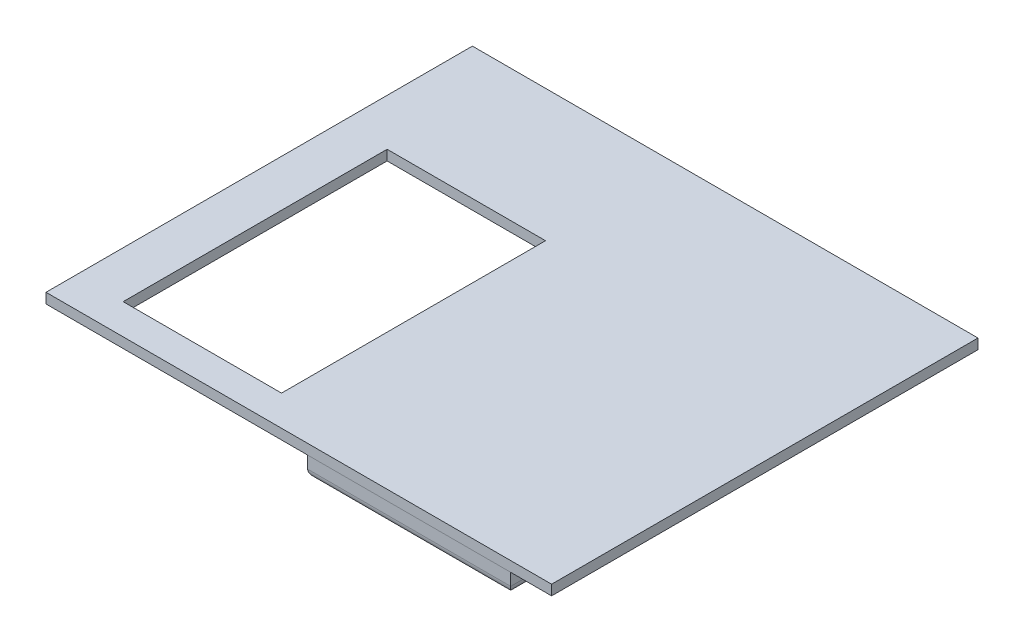
ISO-10303-21;
HEADER;
FILE_DESCRIPTION(('STEP AP214'),'2;1');
FILE_NAME('part.step','',(''),(''),'','','');
FILE_SCHEMA(('AUTOMOTIVE_DESIGN { 1 0 10303 214 1 1 1 1 }'));
ENDSEC;
DATA;
#1=APPLICATION_CONTEXT('core data for automotive mechanical design processes');
#2=APPLICATION_PROTOCOL_DEFINITION('international standard','automotive_design',2000,#1);
#3=PRODUCT_CONTEXT('',#1,'mechanical');
#4=PRODUCT('Part','Part','',(#3));
#5=PRODUCT_RELATED_PRODUCT_CATEGORY('part','',(#4));
#6=PRODUCT_DEFINITION_FORMATION('','',#4);
#7=PRODUCT_DEFINITION_CONTEXT('part definition',#1,'design');
#8=PRODUCT_DEFINITION('design','',#6,#7);
#9=PRODUCT_DEFINITION_SHAPE('','',#8);
#10=(LENGTH_UNIT() NAMED_UNIT(*) SI_UNIT(.MILLI.,.METRE.));
#11=(NAMED_UNIT(*) PLANE_ANGLE_UNIT() SI_UNIT($,.RADIAN.));
#12=(NAMED_UNIT(*) SI_UNIT($,.STERADIAN.) SOLID_ANGLE_UNIT());
#13=UNCERTAINTY_MEASURE_WITH_UNIT(LENGTH_MEASURE(1.E-05),#10,'distance_accuracy_value','');
#14=(GEOMETRIC_REPRESENTATION_CONTEXT(3) GLOBAL_UNCERTAINTY_ASSIGNED_CONTEXT((#13)) GLOBAL_UNIT_ASSIGNED_CONTEXT((#10,
#11,#12)) REPRESENTATION_CONTEXT('',''));
#15=CARTESIAN_POINT('',(0.,0.,0.));
#16=DIRECTION('',(0.,0.,1.));
#17=DIRECTION('',(1.,0.,0.));
#18=AXIS2_PLACEMENT_3D('',#15,#16,#17);
#19=CARTESIAN_POINT('',(52.6626972357937,-5.00000000000001,53.4495540641216));
#20=DIRECTION('',(1.,0.,0.));
#21=DIRECTION('',(0.,0.,1.));
#22=AXIS2_PLACEMENT_3D('',#19,#20,#21);
#23=PLANE('',#22);
#24=DIRECTION('',(0.,1.,0.));
#25=VECTOR('',#24,1.);
#26=CARTESIAN_POINT('',(52.6626972357937,-5.00000000000001,-26.5504459358784));
#27=LINE('',#26,#25);
#28=CARTESIAN_POINT('',(52.6626972357937,-3.00000000000001,-26.5504459358784));
#29=VERTEX_POINT('',#28);
#30=CARTESIAN_POINT('',(52.6626972357937,0.,-26.5504459358784));
#31=VERTEX_POINT('',#30);
#32=EDGE_CURVE('E119',#29,#31,#27,.T.);
#33=ORIENTED_EDGE('',*,*,#32,.F.);
#34=DIRECTION('',(0.,0.,-1.));
#35=VECTOR('',#34,1.);
#36=CARTESIAN_POINT('',(52.6626972357937,-3.00000000000001,53.4495540641216));
#37=LINE('',#36,#35);
#38=CARTESIAN_POINT('',(52.6626972357937,-3.00000000000001,53.4495540641216));
#39=VERTEX_POINT('',#38);
#40=EDGE_CURVE('E194',#29,#39,#37,.F.);
#41=ORIENTED_EDGE('',*,*,#40,.T.);
#42=DIRECTION('',(0.,1.,0.));
#43=VECTOR('',#42,1.);
#44=CARTESIAN_POINT('',(52.6626972357937,-5.00000000000001,53.4495540641216));
#45=LINE('',#44,#43);
#46=CARTESIAN_POINT('',(52.6626972357937,0.,53.4495540641216));
#47=VERTEX_POINT('',#46);
#48=EDGE_CURVE('E139',#39,#47,#45,.T.);
#49=ORIENTED_EDGE('',*,*,#48,.T.);
#50=DIRECTION('',(0.,0.,-1.));
#51=VECTOR('',#50,1.);
#52=CARTESIAN_POINT('',(52.6626972357937,0.,53.4495540641216));
#53=LINE('',#52,#51);
#54=EDGE_CURVE('E134',#47,#31,#53,.T.);
#55=ORIENTED_EDGE('',*,*,#54,.T.);
#56=EDGE_LOOP('',(#33,#41,#49,#55));
#57=FACE_BOUND('',#56,.T.);
#58=ADVANCED_FACE('F52',(#57),#23,.F.);
#59=CARTESIAN_POINT('',(52.6626972357937,-5.00000000000001,-26.5504459358784));
#60=DIRECTION('',(0.,0.,1.));
#61=DIRECTION('',(0.,-1.,0.));
#62=AXIS2_PLACEMENT_3D('',#59,#60,#61);
#63=PLANE('',#62);
#64=DIRECTION('',(0.,1.,0.));
#65=VECTOR('',#64,1.);
#66=CARTESIAN_POINT('',(102.662697235794,-5.00000000000001,-26.5504459358784));
#67=LINE('',#66,#65);
#68=CARTESIAN_POINT('',(102.662697235794,-3.00000000000001,-26.5504459358784));
#69=VERTEX_POINT('',#68);
#70=CARTESIAN_POINT('',(102.662697235794,0.,-26.5504459358784));
#71=VERTEX_POINT('',#70);
#72=EDGE_CURVE('E128',#69,#71,#67,.T.);
#73=ORIENTED_EDGE('',*,*,#72,.F.);
#74=DIRECTION('',(1.,0.,0.));
#75=VECTOR('',#74,1.);
#76=CARTESIAN_POINT('',(52.6626972357937,-3.00000000000001,-26.5504459358784));
#77=LINE('',#76,#75);
#78=EDGE_CURVE('E70',#69,#29,#77,.F.);
#79=ORIENTED_EDGE('',*,*,#78,.T.);
#80=ORIENTED_EDGE('',*,*,#32,.T.);
#81=DIRECTION('',(1.,0.,0.));
#82=VECTOR('',#81,1.);
#83=CARTESIAN_POINT('',(52.6626972357937,0.,-26.5504459358784));
#84=LINE('',#83,#82);
#85=EDGE_CURVE('E122',#31,#71,#84,.T.);
#86=ORIENTED_EDGE('',*,*,#85,.T.);
#87=EDGE_LOOP('',(#73,#79,#80,#86));
#88=FACE_BOUND('',#87,.T.);
#89=ADVANCED_FACE('F121',(#88),#63,.F.);
#90=CARTESIAN_POINT('',(102.662697235794,-5.00000000000001,53.4495540641216));
#91=DIRECTION('',(-1.,0.,0.));
#92=DIRECTION('',(0.,0.,-1.));
#93=AXIS2_PLACEMENT_3D('',#90,#91,#92);
#94=PLANE('',#93);
#95=DIRECTION('',(0.,1.,0.));
#96=VECTOR('',#95,1.);
#97=CARTESIAN_POINT('',(102.662697235794,-5.00000000000001,53.4495540641216));
#98=LINE('',#97,#96);
#99=CARTESIAN_POINT('',(102.662697235794,-3.00000000000001,53.4495540641216));
#100=VERTEX_POINT('',#99);
#101=CARTESIAN_POINT('',(102.662697235794,0.,53.4495540641216));
#102=VERTEX_POINT('',#101);
#103=EDGE_CURVE('E153',#100,#102,#98,.T.);
#104=ORIENTED_EDGE('',*,*,#103,.F.);
#105=DIRECTION('',(0.,0.,1.));
#106=VECTOR('',#105,1.);
#107=CARTESIAN_POINT('',(102.662697235794,-3.00000000000001,-26.5504459358784));
#108=LINE('',#107,#106);
#109=EDGE_CURVE('E78',#100,#69,#108,.F.);
#110=ORIENTED_EDGE('',*,*,#109,.T.);
#111=ORIENTED_EDGE('',*,*,#72,.T.);
#112=DIRECTION('',(0.,0.,1.));
#113=VECTOR('',#112,1.);
#114=CARTESIAN_POINT('',(102.662697235794,0.,53.4495540641216));
#115=LINE('',#114,#113);
#116=EDGE_CURVE('E136',#71,#102,#115,.T.);
#117=ORIENTED_EDGE('',*,*,#116,.T.);
#118=EDGE_LOOP('',(#104,#110,#111,#117));
#119=FACE_BOUND('',#118,.T.);
#120=ADVANCED_FACE('F258',(#119),#94,.F.);
#121=CARTESIAN_POINT('',(52.6626972357937,-5.00000000000001,53.4495540641216));
#122=DIRECTION('',(0.,0.,-1.));
#123=DIRECTION('',(0.,1.,0.));
#124=AXIS2_PLACEMENT_3D('',#121,#122,#123);
#125=PLANE('',#124);
#126=ORIENTED_EDGE('',*,*,#48,.F.);
#127=DIRECTION('',(-1.,0.,0.));
#128=VECTOR('',#127,1.);
#129=CARTESIAN_POINT('',(102.662697235794,-3.00000000000001,53.4495540641216));
#130=LINE('',#129,#128);
#131=EDGE_CURVE('E188',#39,#100,#130,.F.);
#132=ORIENTED_EDGE('',*,*,#131,.T.);
#133=ORIENTED_EDGE('',*,*,#103,.T.);
#134=DIRECTION('',(-1.,0.,0.));
#135=VECTOR('',#134,1.);
#136=CARTESIAN_POINT('',(52.6626972357937,0.,53.4495540641216));
#137=LINE('',#136,#135);
#138=EDGE_CURVE('E150',#102,#47,#137,.T.);
#139=ORIENTED_EDGE('',*,*,#138,.T.);
#140=EDGE_LOOP('',(#126,#132,#133,#139));
#141=FACE_BOUND('',#140,.T.);
#142=ADVANCED_FACE('F353',(#141),#125,.F.);
#143=CARTESIAN_POINT('',(52.6626972357937,-5.00000000000001,-26.5504459358784));
#144=DIRECTION('',(0.,-1.,0.));
#145=DIRECTION('',(1.,0.,0.));
#146=AXIS2_PLACEMENT_3D('',#143,#144,#145);
#147=PLANE('',#146);
#148=CARTESIAN_POINT('',(77.6626972357937,-5.00000000000001,-18.5504459358784));
#149=DIRECTION('',(0.,-1.,0.));
#150=DIRECTION('',(1.,0.,0.));
#151=AXIS2_PLACEMENT_3D('',#148,#149,#150);
#152=CIRCLE('',#151,2.5);
#153=CARTESIAN_POINT('',(80.1626972357937,-5.00000000000001,-18.5504459358784));
#154=VERTEX_POINT('',#153);
#155=EDGE_CURVE('E315',#154,#154,#152,.T.);
#156=ORIENTED_EDGE('',*,*,#155,.F.);
#157=EDGE_LOOP('',(#156));
#158=FACE_BOUND('',#157,.T.);
#159=CARTESIAN_POINT('',(77.6626972357937,-5.00000000000001,45.4495540641216));
#160=DIRECTION('',(0.,-1.,0.));
#161=DIRECTION('',(1.,0.,0.));
#162=AXIS2_PLACEMENT_3D('',#159,#160,#161);
#163=CIRCLE('',#162,2.5);
#164=CARTESIAN_POINT('',(80.1626972357937,-5.00000000000001,45.4495540641216));
#165=VERTEX_POINT('',#164);
#166=EDGE_CURVE('E311',#165,#165,#163,.T.);
#167=ORIENTED_EDGE('',*,*,#166,.F.);
#168=EDGE_LOOP('',(#167));
#169=FACE_BOUND('',#168,.T.);
#170=DIRECTION('',(0.,0.,1.));
#171=VECTOR('',#170,1.);
#172=CARTESIAN_POINT('',(100.662697235794,-5.00000000000001,53.4495540641216));
#173=LINE('',#172,#171);
#174=CARTESIAN_POINT('',(100.662697235794,-5.00000000000001,-24.5504459358784));
#175=VERTEX_POINT('',#174);
#176=CARTESIAN_POINT('',(100.662697235794,-5.00000000000001,51.4495540641216));
#177=VERTEX_POINT('',#176);
#178=EDGE_CURVE('E182',#175,#177,#173,.T.);
#179=ORIENTED_EDGE('',*,*,#178,.T.);
#180=DIRECTION('',(-1.,0.,0.));
#181=VECTOR('',#180,1.);
#182=CARTESIAN_POINT('',(52.6626972357937,-5.00000000000001,51.4495540641216));
#183=LINE('',#182,#181);
#184=CARTESIAN_POINT('',(54.6626972357937,-5.00000000000001,51.4495540641216));
#185=VERTEX_POINT('',#184);
#186=EDGE_CURVE('E185',#177,#185,#183,.T.);
#187=ORIENTED_EDGE('',*,*,#186,.T.);
#188=DIRECTION('',(0.,0.,-1.));
#189=VECTOR('',#188,1.);
#190=CARTESIAN_POINT('',(54.6626972357937,-5.00000000000001,-26.5504459358784));
#191=LINE('',#190,#189);
#192=CARTESIAN_POINT('',(54.6626972357937,-5.00000000000001,-24.5504459358784));
#193=VERTEX_POINT('',#192);
#194=EDGE_CURVE('E178',#185,#193,#191,.T.);
#195=ORIENTED_EDGE('',*,*,#194,.T.);
#196=DIRECTION('',(1.,0.,0.));
#197=VECTOR('',#196,1.);
#198=CARTESIAN_POINT('',(102.662697235794,-5.00000000000001,-24.5504459358784));
#199=LINE('',#198,#197);
#200=EDGE_CURVE('E180',#193,#175,#199,.T.);
#201=ORIENTED_EDGE('',*,*,#200,.T.);
#202=EDGE_LOOP('',(#179,#187,#195,#201));
#203=FACE_BOUND('',#202,.T.);
#204=CARTESIAN_POINT('',(67.6626972357937,-5.00000000000001,-11.5504459358784));
#205=DIRECTION('',(0.,-1.,0.));
#206=DIRECTION('',(1.,0.,0.));
#207=AXIS2_PLACEMENT_3D('',#204,#205,#206);
#208=CIRCLE('',#207,5.);
#209=CARTESIAN_POINT('',(72.6626972357937,-5.00000000000001,-11.5504459358784));
#210=VERTEX_POINT('',#209);
#211=EDGE_CURVE('E175',#210,#210,#208,.F.);
#212=ORIENTED_EDGE('',*,*,#211,.T.);
#213=EDGE_LOOP('',(#212));
#214=FACE_BOUND('',#213,.T.);
#215=CARTESIAN_POINT('',(87.6626972357937,-5.00000000000001,-11.5504459358784));
#216=DIRECTION('',(0.,-1.,0.));
#217=DIRECTION('',(1.,0.,0.));
#218=AXIS2_PLACEMENT_3D('',#215,#216,#217);
#219=CIRCLE('',#218,5.);
#220=CARTESIAN_POINT('',(92.6626972357937,-5.00000000000001,-11.5504459358784));
#221=VERTEX_POINT('',#220);
#222=EDGE_CURVE('E171',#221,#221,#219,.F.);
#223=ORIENTED_EDGE('',*,*,#222,.T.);
#224=EDGE_LOOP('',(#223));
#225=FACE_BOUND('',#224,.T.);
#226=CARTESIAN_POINT('',(90.6626972357937,-5.00000000000001,3.337179155652));
#227=DIRECTION('',(0.,-1.,0.));
#228=DIRECTION('',(1.,0.,0.));
#229=AXIS2_PLACEMENT_3D('',#226,#227,#228);
#230=CIRCLE('',#229,6.);
#231=CARTESIAN_POINT('',(96.6626972357937,-5.00000000000001,3.337179155652));
#232=VERTEX_POINT('',#231);
#233=EDGE_CURVE('E168',#232,#232,#230,.F.);
#234=ORIENTED_EDGE('',*,*,#233,.T.);
#235=EDGE_LOOP('',(#234));
#236=FACE_BOUND('',#235,.T.);
#237=CARTESIAN_POINT('',(64.6626972357937,-5.00000000000001,3.337179155652));
#238=DIRECTION('',(0.,-1.,0.));
#239=DIRECTION('',(1.,0.,0.));
#240=AXIS2_PLACEMENT_3D('',#237,#238,#239);
#241=CIRCLE('',#240,6.);
#242=CARTESIAN_POINT('',(70.6626972357937,-5.00000000000001,3.337179155652));
#243=VERTEX_POINT('',#242);
#244=EDGE_CURVE('E165',#243,#243,#241,.F.);
#245=ORIENTED_EDGE('',*,*,#244,.T.);
#246=EDGE_LOOP('',(#245));
#247=FACE_BOUND('',#246,.T.);
#248=CARTESIAN_POINT('',(77.6626972357937,-5.00000000000001,23.4495540641216));
#249=DIRECTION('',(0.,-1.,0.));
#250=DIRECTION('',(1.,0.,0.));
#251=AXIS2_PLACEMENT_3D('',#248,#249,#250);
#252=CIRCLE('',#251,5.5);
#253=CARTESIAN_POINT('',(83.1626972357937,-5.00000000000001,23.4495540641216));
#254=VERTEX_POINT('',#253);
#255=CARTESIAN_POINT('',(74.8267946017105,-5.00000000000001,28.1620540641216));
#256=VERTEX_POINT('',#255);
#257=EDGE_CURVE('E127',#254,#256,#252,.F.);
#258=ORIENTED_EDGE('',*,*,#257,.T.);
#259=CARTESIAN_POINT('',(77.6626972357937,-5.00000000000001,33.4495540641216));
#260=DIRECTION('',(0.,-1.,0.));
#261=DIRECTION('',(1.,0.,0.));
#262=AXIS2_PLACEMENT_3D('',#259,#260,#261);
#263=CIRCLE('',#262,6.);
#264=CARTESIAN_POINT('',(83.6626972357937,-5.00000000000001,33.4495540641216));
#265=VERTEX_POINT('',#264);
#266=EDGE_CURVE('E162',#256,#265,#263,.F.);
#267=ORIENTED_EDGE('',*,*,#266,.T.);
#268=CARTESIAN_POINT('',(77.6626972357937,-5.00000000000001,33.4495540641216));
#269=DIRECTION('',(0.,-1.,0.));
#270=DIRECTION('',(1.,0.,0.));
#271=AXIS2_PLACEMENT_3D('',#268,#269,#270);
#272=CIRCLE('',#271,6.);
#273=CARTESIAN_POINT('',(80.4985998698769,-5.00000000000001,28.1620540641216));
#274=VERTEX_POINT('',#273);
#275=EDGE_CURVE('E160',#265,#274,#272,.F.);
#276=ORIENTED_EDGE('',*,*,#275,.T.);
#277=CARTESIAN_POINT('',(77.6626972357937,-5.00000000000001,23.4495540641216));
#278=DIRECTION('',(0.,-1.,0.));
#279=DIRECTION('',(1.,0.,0.));
#280=AXIS2_PLACEMENT_3D('',#277,#278,#279);
#281=CIRCLE('',#280,5.5);
#282=EDGE_CURVE('E158',#274,#254,#281,.F.);
#283=ORIENTED_EDGE('',*,*,#282,.T.);
#284=EDGE_LOOP('',(#258,#267,#276,#283));
#285=FACE_BOUND('',#284,.T.);
#286=ADVANCED_FACE('F350',(#158,#169,#203,#214,#225,#236,#247,#285),#147,.T.);
#287=CARTESIAN_POINT('',(52.6626972357937,0.,-26.5504459358784));
#288=DIRECTION('',(0.,-1.,0.));
#289=DIRECTION('',(1.,0.,0.));
#290=AXIS2_PLACEMENT_3D('',#287,#288,#289);
#291=PLANE('',#290);
#292=CARTESIAN_POINT('',(77.6626972357937,0.,-18.5504459358784));
#293=DIRECTION('',(0.,-1.,0.));
#294=DIRECTION('',(1.,0.,0.));
#295=AXIS2_PLACEMENT_3D('',#292,#293,#294);
#296=CIRCLE('',#295,2.5);
#297=CARTESIAN_POINT('',(80.1626972357937,0.,-18.5504459358784));
#298=VERTEX_POINT('',#297);
#299=EDGE_CURVE('E56',#298,#298,#296,.T.);
#300=ORIENTED_EDGE('',*,*,#299,.T.);
#301=EDGE_LOOP('',(#300));
#302=FACE_BOUND('',#301,.T.);
#303=CARTESIAN_POINT('',(77.6626972357937,0.,45.4495540641216));
#304=DIRECTION('',(0.,-1.,0.));
#305=DIRECTION('',(1.,0.,0.));
#306=AXIS2_PLACEMENT_3D('',#303,#304,#305);
#307=CIRCLE('',#306,2.5);
#308=CARTESIAN_POINT('',(80.1626972357937,0.,45.4495540641216));
#309=VERTEX_POINT('',#308);
#310=EDGE_CURVE('E231',#309,#309,#307,.T.);
#311=ORIENTED_EDGE('',*,*,#310,.T.);
#312=EDGE_LOOP('',(#311));
#313=FACE_BOUND('',#312,.T.);
#314=CARTESIAN_POINT('',(77.6626972357937,0.,23.4495540641216));
#315=DIRECTION('',(0.,-1.,0.));
#316=DIRECTION('',(1.,0.,0.));
#317=AXIS2_PLACEMENT_3D('',#314,#315,#316);
#318=CIRCLE('',#317,3.5);
#319=CARTESIAN_POINT('',(81.1626972357937,0.,23.4495540641216));
#320=VERTEX_POINT('',#319);
#321=EDGE_CURVE('E223',#320,#320,#318,.T.);
#322=ORIENTED_EDGE('',*,*,#321,.T.);
#323=EDGE_LOOP('',(#322));
#324=FACE_BOUND('',#323,.T.);
#325=CARTESIAN_POINT('',(64.6626972357937,0.,3.337179155652));
#326=DIRECTION('',(0.,-1.,0.));
#327=DIRECTION('',(1.,0.,0.));
#328=AXIS2_PLACEMENT_3D('',#325,#326,#327);
#329=CIRCLE('',#328,4.);
#330=CARTESIAN_POINT('',(68.6626972357937,0.,3.337179155652));
#331=VERTEX_POINT('',#330);
#332=EDGE_CURVE('E306',#331,#331,#329,.T.);
#333=ORIENTED_EDGE('',*,*,#332,.T.);
#334=EDGE_LOOP('',(#333));
#335=FACE_BOUND('',#334,.T.);
#336=CARTESIAN_POINT('',(90.6626972357937,0.,3.337179155652));
#337=DIRECTION('',(0.,-1.,0.));
#338=DIRECTION('',(1.,0.,0.));
#339=AXIS2_PLACEMENT_3D('',#336,#337,#338);
#340=CIRCLE('',#339,4.);
#341=CARTESIAN_POINT('',(94.6626972357937,0.,3.337179155652));
#342=VERTEX_POINT('',#341);
#343=EDGE_CURVE('E301',#342,#342,#340,.T.);
#344=ORIENTED_EDGE('',*,*,#343,.T.);
#345=EDGE_LOOP('',(#344));
#346=FACE_BOUND('',#345,.T.);
#347=CARTESIAN_POINT('',(77.6626972357937,0.,33.4495540641216));
#348=DIRECTION('',(0.,-1.,0.));
#349=DIRECTION('',(1.,0.,0.));
#350=AXIS2_PLACEMENT_3D('',#347,#348,#349);
#351=CIRCLE('',#350,4.);
#352=CARTESIAN_POINT('',(81.6626972357937,0.,33.4495540641216));
#353=VERTEX_POINT('',#352);
#354=EDGE_CURVE('E299',#353,#353,#351,.T.);
#355=ORIENTED_EDGE('',*,*,#354,.T.);
#356=EDGE_LOOP('',(#355));
#357=FACE_BOUND('',#356,.T.);
#358=CARTESIAN_POINT('',(87.6626972357937,0.,-11.5504459358784));
#359=DIRECTION('',(0.,-1.,0.));
#360=DIRECTION('',(1.,0.,0.));
#361=AXIS2_PLACEMENT_3D('',#358,#359,#360);
#362=CIRCLE('',#361,3.);
#363=CARTESIAN_POINT('',(90.6626972357937,0.,-11.5504459358784));
#364=VERTEX_POINT('',#363);
#365=EDGE_CURVE('E144',#364,#364,#362,.T.);
#366=ORIENTED_EDGE('',*,*,#365,.T.);
#367=EDGE_LOOP('',(#366));
#368=FACE_BOUND('',#367,.T.);
#369=CARTESIAN_POINT('',(67.6626972357937,0.,-11.5504459358784));
#370=DIRECTION('',(0.,-1.,0.));
#371=DIRECTION('',(1.,0.,0.));
#372=AXIS2_PLACEMENT_3D('',#369,#370,#371);
#373=CIRCLE('',#372,3.);
#374=CARTESIAN_POINT('',(70.6626972357937,0.,-11.5504459358784));
#375=VERTEX_POINT('',#374);
#376=EDGE_CURVE('E141',#375,#375,#373,.T.);
#377=ORIENTED_EDGE('',*,*,#376,.T.);
#378=EDGE_LOOP('',(#377));
#379=FACE_BOUND('',#378,.T.);
#380=ORIENTED_EDGE('',*,*,#54,.F.);
#381=ORIENTED_EDGE('',*,*,#138,.F.);
#382=ORIENTED_EDGE('',*,*,#116,.F.);
#383=ORIENTED_EDGE('',*,*,#85,.F.);
#384=EDGE_LOOP('',(#380,#381,#382,#383));
#385=FACE_BOUND('',#384,.T.);
#386=ADVANCED_FACE('F132',(#302,#313,#324,#335,#346,#357,#368,#379,#385),#291,.F.);
#387=CARTESIAN_POINT('',(67.6626972357937,0.,-11.5504459358784));
#388=DIRECTION('',(0.,-1.,0.));
#389=DIRECTION('',(1.,0.,0.));
#390=AXIS2_PLACEMENT_3D('',#387,#388,#389);
#391=CYLINDRICAL_SURFACE('',#390,3.);
#392=CARTESIAN_POINT('',(67.6626972357937,-3.00000000000001,-11.5504459358784));
#393=DIRECTION('',(0.,-1.,0.));
#394=DIRECTION('',(1.,0.,0.));
#395=AXIS2_PLACEMENT_3D('',#392,#393,#394);
#396=CIRCLE('',#395,3.);
#397=CARTESIAN_POINT('',(70.6626972357937,-3.00000000000001,-11.5504459358784));
#398=VERTEX_POINT('',#397);
#399=EDGE_CURVE('E196',#398,#398,#396,.T.);
#400=ORIENTED_EDGE('',*,*,#399,.T.);
#401=EDGE_LOOP('',(#400));
#402=FACE_BOUND('',#401,.T.);
#403=ORIENTED_EDGE('',*,*,#376,.F.);
#404=EDGE_LOOP('',(#403));
#405=FACE_BOUND('',#404,.T.);
#406=ADVANCED_FACE('F294',(#402,#405),#391,.F.);
#407=CARTESIAN_POINT('',(87.6626972357937,0.,-11.5504459358784));
#408=DIRECTION('',(0.,-1.,0.));
#409=DIRECTION('',(1.,0.,0.));
#410=AXIS2_PLACEMENT_3D('',#407,#408,#409);
#411=CYLINDRICAL_SURFACE('',#410,3.);
#412=CARTESIAN_POINT('',(87.6626972357937,-3.00000000000001,-11.5504459358784));
#413=DIRECTION('',(0.,-1.,0.));
#414=DIRECTION('',(1.,0.,0.));
#415=AXIS2_PLACEMENT_3D('',#412,#413,#414);
#416=CIRCLE('',#415,3.);
#417=CARTESIAN_POINT('',(90.6626972357937,-3.00000000000001,-11.5504459358784));
#418=VERTEX_POINT('',#417);
#419=EDGE_CURVE('E199',#418,#418,#416,.T.);
#420=ORIENTED_EDGE('',*,*,#419,.T.);
#421=EDGE_LOOP('',(#420));
#422=FACE_BOUND('',#421,.T.);
#423=ORIENTED_EDGE('',*,*,#365,.F.);
#424=EDGE_LOOP('',(#423));
#425=FACE_BOUND('',#424,.T.);
#426=ADVANCED_FACE('F290',(#422,#425),#411,.F.);
#427=CARTESIAN_POINT('',(77.6626972357937,0.,33.4495540641216));
#428=DIRECTION('',(0.,-1.,0.));
#429=DIRECTION('',(1.,0.,0.));
#430=AXIS2_PLACEMENT_3D('',#427,#428,#429);
#431=CYLINDRICAL_SURFACE('',#430,4.);
#432=CARTESIAN_POINT('',(77.6626972357937,-3.00000000000001,33.4495540641216));
#433=DIRECTION('',(0.,-1.,0.));
#434=DIRECTION('',(1.,0.,0.));
#435=AXIS2_PLACEMENT_3D('',#432,#433,#434);
#436=CIRCLE('',#435,4.);
#437=CARTESIAN_POINT('',(81.6626972357937,-3.00000000000001,33.4495540641216));
#438=VERTEX_POINT('',#437);
#439=EDGE_CURVE('E202',#438,#438,#436,.T.);
#440=ORIENTED_EDGE('',*,*,#439,.T.);
#441=EDGE_LOOP('',(#440));
#442=FACE_BOUND('',#441,.T.);
#443=ORIENTED_EDGE('',*,*,#354,.F.);
#444=EDGE_LOOP('',(#443));
#445=FACE_BOUND('',#444,.T.);
#446=ADVANCED_FACE('F293',(#442,#445),#431,.F.);
#447=CARTESIAN_POINT('',(90.6626972357937,0.,3.337179155652));
#448=DIRECTION('',(0.,-1.,0.));
#449=DIRECTION('',(1.,0.,0.));
#450=AXIS2_PLACEMENT_3D('',#447,#448,#449);
#451=CYLINDRICAL_SURFACE('',#450,4.);
#452=CARTESIAN_POINT('',(90.6626972357937,-3.00000000000001,3.337179155652));
#453=DIRECTION('',(0.,-1.,0.));
#454=DIRECTION('',(1.,0.,0.));
#455=AXIS2_PLACEMENT_3D('',#452,#453,#454);
#456=CIRCLE('',#455,4.);
#457=CARTESIAN_POINT('',(94.6626972357937,-3.00000000000001,3.337179155652));
#458=VERTEX_POINT('',#457);
#459=EDGE_CURVE('E206',#458,#458,#456,.T.);
#460=ORIENTED_EDGE('',*,*,#459,.T.);
#461=EDGE_LOOP('',(#460));
#462=FACE_BOUND('',#461,.T.);
#463=ORIENTED_EDGE('',*,*,#343,.F.);
#464=EDGE_LOOP('',(#463));
#465=FACE_BOUND('',#464,.T.);
#466=ADVANCED_FACE('F339',(#462,#465),#451,.F.);
#467=CARTESIAN_POINT('',(64.6626972357937,0.,3.337179155652));
#468=DIRECTION('',(0.,-1.,0.));
#469=DIRECTION('',(1.,0.,0.));
#470=AXIS2_PLACEMENT_3D('',#467,#468,#469);
#471=CYLINDRICAL_SURFACE('',#470,4.);
#472=CARTESIAN_POINT('',(64.6626972357937,-3.00000000000001,3.337179155652));
#473=DIRECTION('',(0.,-1.,0.));
#474=DIRECTION('',(1.,0.,0.));
#475=AXIS2_PLACEMENT_3D('',#472,#473,#474);
#476=CIRCLE('',#475,4.);
#477=CARTESIAN_POINT('',(68.6626972357937,-3.00000000000001,3.337179155652));
#478=VERTEX_POINT('',#477);
#479=EDGE_CURVE('E62',#478,#478,#476,.T.);
#480=ORIENTED_EDGE('',*,*,#479,.T.);
#481=EDGE_LOOP('',(#480));
#482=FACE_BOUND('',#481,.T.);
#483=ORIENTED_EDGE('',*,*,#332,.F.);
#484=EDGE_LOOP('',(#483));
#485=FACE_BOUND('',#484,.T.);
#486=ADVANCED_FACE('F335',(#482,#485),#471,.F.);
#487=CARTESIAN_POINT('',(77.6626972357937,0.,23.4495540641216));
#488=DIRECTION('',(0.,-1.,0.));
#489=DIRECTION('',(1.,0.,0.));
#490=AXIS2_PLACEMENT_3D('',#487,#488,#489);
#491=CYLINDRICAL_SURFACE('',#490,3.5);
#492=CARTESIAN_POINT('',(77.6626972357937,-3.00000000000001,23.4495540641216));
#493=DIRECTION('',(0.,-1.,0.));
#494=DIRECTION('',(1.,0.,0.));
#495=AXIS2_PLACEMENT_3D('',#492,#493,#494);
#496=CIRCLE('',#495,3.5);
#497=CARTESIAN_POINT('',(81.1626972357937,-3.00000000000001,23.4495540641216));
#498=VERTEX_POINT('',#497);
#499=EDGE_CURVE('E12',#498,#498,#496,.T.);
#500=ORIENTED_EDGE('',*,*,#499,.T.);
#501=EDGE_LOOP('',(#500));
#502=FACE_BOUND('',#501,.T.);
#503=ORIENTED_EDGE('',*,*,#321,.F.);
#504=EDGE_LOOP('',(#503));
#505=FACE_BOUND('',#504,.T.);
#506=ADVANCED_FACE('F278',(#502,#505),#491,.F.);
#507=CARTESIAN_POINT('',(52.6626972357937,-3.00000000000001,-24.5504459358784));
#508=DIRECTION('',(-1.,0.,0.));
#509=DIRECTION('',(0.,-1.,0.));
#510=AXIS2_PLACEMENT_3D('',#507,#508,#509);
#511=CYLINDRICAL_SURFACE('',#510,2.);
#512=CARTESIAN_POINT('',(54.6626972357937,-3.00000000000001,-24.5504459358784));
#513=DIRECTION('',(-0.707106781186548,0.,0.707106781186547));
#514=DIRECTION('',(0.707106781186547,0.,0.707106781186548));
#515=AXIS2_PLACEMENT_3D('',#512,#513,#514);
#516=ELLIPSE('',#515,2.82842712474619,2.);
#517=EDGE_CURVE('E217',#29,#193,#516,.T.);
#518=ORIENTED_EDGE('',*,*,#517,.F.);
#519=ORIENTED_EDGE('',*,*,#78,.F.);
#520=CARTESIAN_POINT('',(100.662697235794,-3.00000000000001,-24.5504459358784));
#521=DIRECTION('',(-0.707106781186547,0.,-0.707106781186548));
#522=DIRECTION('',(-0.707106781186548,0.,0.707106781186547));
#523=AXIS2_PLACEMENT_3D('',#520,#521,#522);
#524=ELLIPSE('',#523,2.82842712474619,2.);
#525=EDGE_CURVE('E220',#175,#69,#524,.F.);
#526=ORIENTED_EDGE('',*,*,#525,.F.);
#527=ORIENTED_EDGE('',*,*,#200,.F.);
#528=EDGE_LOOP('',(#518,#519,#526,#527));
#529=FACE_BOUND('',#528,.T.);
#530=ADVANCED_FACE('F274',(#529),#511,.T.);
#531=CARTESIAN_POINT('',(100.662697235794,-3.00000000000001,-26.5504459358784));
#532=DIRECTION('',(0.,0.,-1.));
#533=DIRECTION('',(1.,0.,0.));
#534=AXIS2_PLACEMENT_3D('',#531,#532,#533);
#535=CYLINDRICAL_SURFACE('',#534,2.);
#536=ORIENTED_EDGE('',*,*,#525,.T.);
#537=ORIENTED_EDGE('',*,*,#109,.F.);
#538=CARTESIAN_POINT('',(100.662697235794,-3.00000000000001,51.4495540641216));
#539=DIRECTION('',(0.707106781186548,0.,-0.707106781186547));
#540=DIRECTION('',(-0.707106781186547,0.,-0.707106781186548));
#541=AXIS2_PLACEMENT_3D('',#538,#539,#540);
#542=ELLIPSE('',#541,2.82842712474619,2.);
#543=EDGE_CURVE('E214',#177,#100,#542,.F.);
#544=ORIENTED_EDGE('',*,*,#543,.F.);
#545=ORIENTED_EDGE('',*,*,#178,.F.);
#546=EDGE_LOOP('',(#536,#537,#544,#545));
#547=FACE_BOUND('',#546,.T.);
#548=ADVANCED_FACE('F270',(#547),#535,.T.);
#549=CARTESIAN_POINT('',(54.6626972357937,-3.00000000000001,-26.5504459358784));
#550=DIRECTION('',(0.,0.,1.));
#551=DIRECTION('',(-1.,0.,0.));
#552=AXIS2_PLACEMENT_3D('',#549,#550,#551);
#553=CYLINDRICAL_SURFACE('',#552,2.);
#554=ORIENTED_EDGE('',*,*,#517,.T.);
#555=ORIENTED_EDGE('',*,*,#194,.F.);
#556=CARTESIAN_POINT('',(54.6626972357937,-3.00000000000001,51.4495540641216));
#557=DIRECTION('',(0.707106781186547,0.,0.707106781186548));
#558=DIRECTION('',(-0.707106781186548,0.,0.707106781186547));
#559=AXIS2_PLACEMENT_3D('',#556,#557,#558);
#560=ELLIPSE('',#559,2.82842712474619,2.);
#561=EDGE_CURVE('E212',#39,#185,#560,.T.);
#562=ORIENTED_EDGE('',*,*,#561,.F.);
#563=ORIENTED_EDGE('',*,*,#40,.F.);
#564=EDGE_LOOP('',(#554,#555,#562,#563));
#565=FACE_BOUND('',#564,.T.);
#566=ADVANCED_FACE('F266',(#565),#553,.T.);
#567=CARTESIAN_POINT('',(52.6626972357937,-3.00000000000001,51.4495540641216));
#568=DIRECTION('',(1.,0.,0.));
#569=DIRECTION('',(0.,1.,0.));
#570=AXIS2_PLACEMENT_3D('',#567,#568,#569);
#571=CYLINDRICAL_SURFACE('',#570,2.);
#572=ORIENTED_EDGE('',*,*,#543,.T.);
#573=ORIENTED_EDGE('',*,*,#131,.F.);
#574=ORIENTED_EDGE('',*,*,#561,.T.);
#575=ORIENTED_EDGE('',*,*,#186,.F.);
#576=EDGE_LOOP('',(#572,#573,#574,#575));
#577=FACE_BOUND('',#576,.T.);
#578=ADVANCED_FACE('F262',(#577),#571,.T.);
#579=CARTESIAN_POINT('',(67.6626972357937,-3.00000000000001,-11.5504459358784));
#580=DIRECTION('',(0.,-1.,0.));
#581=DIRECTION('',(1.,0.,0.));
#582=AXIS2_PLACEMENT_3D('',#579,#580,#581);
#583=TOROIDAL_SURFACE('',#582,5.,2.);
#584=ORIENTED_EDGE('',*,*,#211,.F.);
#585=EDGE_LOOP('',(#584));
#586=FACE_BOUND('',#585,.T.);
#587=ORIENTED_EDGE('',*,*,#399,.F.);
#588=EDGE_LOOP('',(#587));
#589=FACE_BOUND('',#588,.T.);
#590=ADVANCED_FACE('F265',(#586,#589),#583,.T.);
#591=CARTESIAN_POINT('',(87.6626972357937,-3.00000000000001,-11.5504459358784));
#592=DIRECTION('',(0.,-1.,0.));
#593=DIRECTION('',(1.,0.,0.));
#594=AXIS2_PLACEMENT_3D('',#591,#592,#593);
#595=TOROIDAL_SURFACE('',#594,5.,2.);
#596=ORIENTED_EDGE('',*,*,#222,.F.);
#597=EDGE_LOOP('',(#596));
#598=FACE_BOUND('',#597,.T.);
#599=ORIENTED_EDGE('',*,*,#419,.F.);
#600=EDGE_LOOP('',(#599));
#601=FACE_BOUND('',#600,.T.);
#602=ADVANCED_FACE('F239',(#598,#601),#595,.T.);
#603=CARTESIAN_POINT('',(77.6626972357937,-3.00000000000001,23.4495540641216));
#604=DIRECTION('',(0.,-1.,0.));
#605=DIRECTION('',(1.,0.,0.));
#606=AXIS2_PLACEMENT_3D('',#603,#604,#605);
#607=TOROIDAL_SURFACE('',#606,5.5,2.);
#608=ORIENTED_EDGE('',*,*,#499,.F.);
#609=EDGE_LOOP('',(#608));
#610=FACE_BOUND('',#609,.T.);
#611=CARTESIAN_POINT('',(74.8267946017105,-5.,28.1620540641216));
#612=CARTESIAN_POINT('',(74.8300097782624,-4.99999999171081,28.1621335494009));
#613=CARTESIAN_POINT('',(74.8332249393517,-4.99999809653961,28.1622129318456));
#614=CARTESIAN_POINT('',(75.1698923349641,-4.99960354322482,28.1705145085473));
#615=CARTESIAN_POINT('',(75.5031739065019,-4.97906842900862,28.1776279556835));
#616=CARTESIAN_POINT('',(76.0023739702365,-4.94163175163199,28.186214969392));
#617=CARTESIAN_POINT('',(76.1687589899649,-4.92803645128732,28.188731048697));
#618=CARTESIAN_POINT('',(76.5016491007296,-4.90227462250857,28.1930120750767));
#619=CARTESIAN_POINT('',(76.6681541430262,-4.89010768136023,28.1947772395117));
#620=CARTESIAN_POINT('',(77.001509153757,-4.87032118910938,28.1975066665901));
#621=CARTESIAN_POINT('',(77.1683592159069,-4.86270310186863,28.1984706714522));
#622=CARTESIAN_POINT('',(77.5022353532028,-4.85400855990673,28.1995640153093));
#623=CARTESIAN_POINT('',(77.6692614103844,-4.8529314920751,28.1996934325329));
#624=CARTESIAN_POINT('',(78.003190997179,-4.85760361351105,28.1991129090608));
#625=CARTESIAN_POINT('',(78.1700945369615,-4.86335215153379,28.1984030484422));
#626=CARTESIAN_POINT('',(78.5036315634318,-4.88016482126499,28.1961692669929));
#627=CARTESIAN_POINT('',(78.6702650003163,-4.89122984132855,28.1946452101097));
#628=CARTESIAN_POINT('',(78.974399395428,-4.91368963142406,28.1911606056562));
#629=CARTESIAN_POINT('',(79.1119332625087,-4.92469330397033,28.1893218528455));
#630=CARTESIAN_POINT('',(79.3870230785641,-4.94639764370465,28.1851513147311));
#631=CARTESIAN_POINT('',(79.5245790278757,-4.95709830571384,28.1828195210064));
#632=CARTESIAN_POINT('',(79.7998430543068,-4.97606418389226,28.1776971512444));
#633=CARTESIAN_POINT('',(79.9375511119897,-4.98432968162013,28.1749066283045));
#634=CARTESIAN_POINT('',(80.2131600613607,-4.99621317571077,28.1689042006374));
#635=CARTESIAN_POINT('',(80.3510608906897,-4.99983243072408,28.16569241029));
#636=CARTESIAN_POINT('',(80.4921695524721,-4.99999810345134,28.1622129312089));
#637=CARTESIAN_POINT('',(80.4953847139433,-4.99999999871894,28.1621335487363));
#638=CARTESIAN_POINT('',(80.4985998698769,-5.00000000000001,28.1620540641216));
#639=B_SPLINE_CURVE_WITH_KNOTS('',3,(#611,#612,#613,#614,#615,#616,#617,#618,#619,#620,#621,
#622,#623,#624,#625,#626,#627,#628,#629,#630,#631,#632,#633,#634,#635,#636,#637,#638),
.UNSPECIFIED.,.F.,.F.,(4,2,2,2,2,2,2,2,2,2,2,2,2,4),(0.,0.00964842400878638,1.01031510520356,
1.51128481778328,2.01210942057836,2.51309510645757,3.01403383263656,3.51492476708035,
4.01589942678359,4.42985844176828,4.84382452760522,5.25774273103983,5.67154878183513,
5.68119720584487),.UNSPECIFIED.);
#640=EDGE_CURVE('E215',#256,#274,#639,.T.);
#641=ORIENTED_EDGE('',*,*,#640,.F.);
#642=ORIENTED_EDGE('',*,*,#257,.F.);
#643=ORIENTED_EDGE('',*,*,#282,.F.);
#644=EDGE_LOOP('',(#641,#642,#643));
#645=FACE_BOUND('',#644,.T.);
#646=ADVANCED_FACE('F234',(#610,#645),#607,.T.);
#647=CARTESIAN_POINT('',(77.6626972357937,-3.00000000000001,33.4495540641216));
#648=DIRECTION('',(0.,-1.,0.));
#649=DIRECTION('',(1.,0.,0.));
#650=AXIS2_PLACEMENT_3D('',#647,#648,#649);
#651=TOROIDAL_SURFACE('',#650,6.,2.);
#652=ORIENTED_EDGE('',*,*,#266,.F.);
#653=ORIENTED_EDGE('',*,*,#640,.T.);
#654=ORIENTED_EDGE('',*,*,#275,.F.);
#655=EDGE_LOOP('',(#652,#653,#654));
#656=FACE_BOUND('',#655,.T.);
#657=ORIENTED_EDGE('',*,*,#439,.F.);
#658=EDGE_LOOP('',(#657));
#659=FACE_BOUND('',#658,.T.);
#660=ADVANCED_FACE('F238',(#656,#659),#651,.T.);
#661=CARTESIAN_POINT('',(90.6626972357937,-3.00000000000001,3.337179155652));
#662=DIRECTION('',(0.,-1.,0.));
#663=DIRECTION('',(1.,0.,0.));
#664=AXIS2_PLACEMENT_3D('',#661,#662,#663);
#665=TOROIDAL_SURFACE('',#664,6.,2.);
#666=ORIENTED_EDGE('',*,*,#233,.F.);
#667=EDGE_LOOP('',(#666));
#668=FACE_BOUND('',#667,.T.);
#669=ORIENTED_EDGE('',*,*,#459,.F.);
#670=EDGE_LOOP('',(#669));
#671=FACE_BOUND('',#670,.T.);
#672=ADVANCED_FACE('F242',(#668,#671),#665,.T.);
#673=CARTESIAN_POINT('',(64.6626972357937,-3.00000000000001,3.337179155652));
#674=DIRECTION('',(0.,-1.,0.));
#675=DIRECTION('',(1.,0.,0.));
#676=AXIS2_PLACEMENT_3D('',#673,#674,#675);
#677=TOROIDAL_SURFACE('',#676,6.,2.);
#678=ORIENTED_EDGE('',*,*,#244,.F.);
#679=EDGE_LOOP('',(#678));
#680=FACE_BOUND('',#679,.T.);
#681=ORIENTED_EDGE('',*,*,#479,.F.);
#682=EDGE_LOOP('',(#681));
#683=FACE_BOUND('',#682,.T.);
#684=ADVANCED_FACE('F54',(#680,#683),#677,.T.);
#685=CARTESIAN_POINT('',(77.6626972357937,4.99999999999999,45.4495540641216));
#686=DIRECTION('',(0.,-1.,0.));
#687=DIRECTION('',(1.,0.,0.));
#688=AXIS2_PLACEMENT_3D('',#685,#686,#687);
#689=CYLINDRICAL_SURFACE('',#688,2.5);
#690=ORIENTED_EDGE('',*,*,#166,.T.);
#691=EDGE_LOOP('',(#690));
#692=FACE_BOUND('',#691,.T.);
#693=ORIENTED_EDGE('',*,*,#310,.F.);
#694=EDGE_LOOP('',(#693));
#695=FACE_BOUND('',#694,.T.);
#696=ADVANCED_FACE('F249',(#692,#695),#689,.F.);
#697=CARTESIAN_POINT('',(77.6626972357937,4.99999999999999,-18.5504459358784));
#698=DIRECTION('',(0.,-1.,0.));
#699=DIRECTION('',(1.,0.,0.));
#700=AXIS2_PLACEMENT_3D('',#697,#698,#699);
#701=CYLINDRICAL_SURFACE('',#700,2.5);
#702=ORIENTED_EDGE('',*,*,#155,.T.);
#703=EDGE_LOOP('',(#702));
#704=FACE_BOUND('',#703,.T.);
#705=ORIENTED_EDGE('',*,*,#299,.F.);
#706=EDGE_LOOP('',(#705));
#707=FACE_BOUND('',#706,.T.);
#708=ADVANCED_FACE('F324',(#704,#707),#701,.F.);
#709=CLOSED_SHELL('',(#58,#89,#120,#142,#286,#386,#406,#426,#446,#466,#486,#506,#530,#548,#566,
#578,#590,#602,#646,#660,#672,#684,#696,#708));
#710=MANIFOLD_SOLID_BREP('B2',#709);
#711=CARTESIAN_POINT('',(0.,2.5,0.));
#712=DIRECTION('',(0.,1.,0.));
#713=DIRECTION('',(0.,0.,1.));
#714=AXIS2_PLACEMENT_3D('',#711,#712,#713);
#715=PLANE('',#714);
#716=DIRECTION('',(-1.,0.,0.));
#717=VECTOR('',#716,1.);
#718=CARTESIAN_POINT('',(-76.7673716012085,2.5,-51.5483383685801));
#719=LINE('',#718,#717);
#720=CARTESIAN_POINT('',(112.732628398792,2.5,-51.5483383685801));
#721=VERTEX_POINT('',#720);
#722=CARTESIAN_POINT('',(-11.7673716012085,2.5,-51.5483383685801));
#723=VERTEX_POINT('',#722);
#724=EDGE_CURVE('E681',#721,#723,#719,.T.);
#725=ORIENTED_EDGE('',*,*,#724,.T.);
#726=DIRECTION('',(0.,0.,1.));
#727=VECTOR('',#726,1.);
#728=CARTESIAN_POINT('',(-11.7673716012085,2.5,0.));
#729=LINE('',#728,#727);
#730=CARTESIAN_POINT('',(-11.7673716012085,2.5,53.4516616314199));
#731=VERTEX_POINT('',#730);
#732=EDGE_CURVE('E677',#723,#731,#729,.T.);
#733=ORIENTED_EDGE('',*,*,#732,.T.);
#734=DIRECTION('',(1.,0.,0.));
#735=VECTOR('',#734,1.);
#736=CARTESIAN_POINT('',(-76.7673716012085,2.5,53.4516616314199));
#737=LINE('',#736,#735);
#738=CARTESIAN_POINT('',(112.732628398792,2.5,53.4516616314199));
#739=VERTEX_POINT('',#738);
#740=EDGE_CURVE('E671',#731,#739,#737,.T.);
#741=ORIENTED_EDGE('',*,*,#740,.T.);
#742=DIRECTION('',(0.,0.,-1.));
#743=VECTOR('',#742,1.);
#744=CARTESIAN_POINT('',(112.732628398792,2.5,-51.5483383685801));
#745=LINE('',#744,#743);
#746=EDGE_CURVE('E675',#739,#721,#745,.T.);
#747=ORIENTED_EDGE('',*,*,#746,.T.);
#748=EDGE_LOOP('',(#725,#733,#741,#747));
#749=FACE_BOUND('',#748,.T.);
#750=DIRECTION('',(1.,0.,0.));
#751=VECTOR('',#750,1.);
#752=CARTESIAN_POINT('',(-0.267371601208459,2.5,45.9516616314199));
#753=LINE('',#752,#751);
#754=CARTESIAN_POINT('',(-0.267371601208459,2.5,45.9516616314199));
#755=VERTEX_POINT('',#754);
#756=CARTESIAN_POINT('',(38.7326283987915,2.5,45.9516616314199));
#757=VERTEX_POINT('',#756);
#758=EDGE_CURVE('E702',#755,#757,#753,.T.);
#759=ORIENTED_EDGE('',*,*,#758,.F.);
#760=DIRECTION('',(0.,0.,1.));
#761=VECTOR('',#760,1.);
#762=CARTESIAN_POINT('',(-0.267371601208468,2.5,-19.0483383685801));
#763=LINE('',#762,#761);
#764=CARTESIAN_POINT('',(-0.267371601208468,2.5,-19.0483383685801));
#765=VERTEX_POINT('',#764);
#766=EDGE_CURVE('E700',#765,#755,#763,.T.);
#767=ORIENTED_EDGE('',*,*,#766,.F.);
#768=DIRECTION('',(-1.,0.,0.));
#769=VECTOR('',#768,1.);
#770=CARTESIAN_POINT('',(-0.267371601208468,2.5,-19.0483383685801));
#771=LINE('',#770,#769);
#772=CARTESIAN_POINT('',(38.7326283987915,2.5,-19.0483383685801));
#773=VERTEX_POINT('',#772);
#774=EDGE_CURVE('E706',#773,#765,#771,.T.);
#775=ORIENTED_EDGE('',*,*,#774,.F.);
#776=DIRECTION('',(0.,0.,-1.));
#777=VECTOR('',#776,1.);
#778=CARTESIAN_POINT('',(38.7326283987915,2.5,-19.0483383685801));
#779=LINE('',#778,#777);
#780=EDGE_CURVE('E704',#757,#773,#779,.T.);
#781=ORIENTED_EDGE('',*,*,#780,.F.);
#782=EDGE_LOOP('',(#759,#767,#775,#781));
#783=FACE_BOUND('',#782,.T.);
#784=ADVANCED_FACE('F607',(#749,#783),#715,.T.);
#785=CARTESIAN_POINT('',(0.,0.,0.));
#786=DIRECTION('',(0.,1.,0.));
#787=DIRECTION('',(0.,0.,1.));
#788=AXIS2_PLACEMENT_3D('',#785,#786,#787);
#789=PLANE('',#788);
#790=DIRECTION('',(0.,0.,-1.));
#791=VECTOR('',#790,1.);
#792=CARTESIAN_POINT('',(-11.7673716012085,0.,-51.5483383685801));
#793=LINE('',#792,#791);
#794=CARTESIAN_POINT('',(-11.7673716012085,0.,53.4516616314199));
#795=VERTEX_POINT('',#794);
#796=CARTESIAN_POINT('',(-11.7673716012085,0.,-51.5483383685801));
#797=VERTEX_POINT('',#796);
#798=EDGE_CURVE('E716',#795,#797,#793,.T.);
#799=ORIENTED_EDGE('',*,*,#798,.T.);
#800=DIRECTION('',(-1.,0.,0.));
#801=VECTOR('',#800,1.);
#802=CARTESIAN_POINT('',(-76.7673716012085,0.,-51.5483383685801));
#803=LINE('',#802,#801);
#804=CARTESIAN_POINT('',(112.732628398792,0.,-51.5483383685801));
#805=VERTEX_POINT('',#804);
#806=EDGE_CURVE('E682',#805,#797,#803,.T.);
#807=ORIENTED_EDGE('',*,*,#806,.F.);
#808=DIRECTION('',(0.,0.,-1.));
#809=VECTOR('',#808,1.);
#810=CARTESIAN_POINT('',(112.732628398792,0.,-51.5483383685801));
#811=LINE('',#810,#809);
#812=CARTESIAN_POINT('',(112.732628398792,0.,53.4516616314199));
#813=VERTEX_POINT('',#812);
#814=EDGE_CURVE('E691',#813,#805,#811,.T.);
#815=ORIENTED_EDGE('',*,*,#814,.F.);
#816=DIRECTION('',(1.,0.,0.));
#817=VECTOR('',#816,1.);
#818=CARTESIAN_POINT('',(-76.7673716012085,0.,53.4516616314199));
#819=LINE('',#818,#817);
#820=EDGE_CURVE('E694',#795,#813,#819,.T.);
#821=ORIENTED_EDGE('',*,*,#820,.F.);
#822=EDGE_LOOP('',(#799,#807,#815,#821));
#823=FACE_BOUND('',#822,.T.);
#824=DIRECTION('',(0.,0.,-1.));
#825=VECTOR('',#824,1.);
#826=CARTESIAN_POINT('',(-0.267371601208465,0.,0.));
#827=LINE('',#826,#825);
#828=CARTESIAN_POINT('',(-0.267371601208459,0.,45.9516616314199));
#829=VERTEX_POINT('',#828);
#830=CARTESIAN_POINT('',(-0.267371601208468,0.,-19.0483383685801));
#831=VERTEX_POINT('',#830);
#832=EDGE_CURVE('E50',#829,#831,#827,.T.);
#833=ORIENTED_EDGE('',*,*,#832,.F.);
#834=DIRECTION('',(-1.,0.,0.));
#835=VECTOR('',#834,1.);
#836=CARTESIAN_POINT('',(0.,0.,45.9516616314199));
#837=LINE('',#836,#835);
#838=CARTESIAN_POINT('',(38.7326283987915,0.,45.9516616314199));
#839=VERTEX_POINT('',#838);
#840=EDGE_CURVE('E615',#839,#829,#837,.T.);
#841=ORIENTED_EDGE('',*,*,#840,.F.);
#842=DIRECTION('',(0.,0.,1.));
#843=VECTOR('',#842,1.);
#844=CARTESIAN_POINT('',(38.7326283987915,0.,0.));
#845=LINE('',#844,#843);
#846=CARTESIAN_POINT('',(38.7326283987915,0.,-19.0483383685801));
#847=VERTEX_POINT('',#846);
#848=EDGE_CURVE('E730',#847,#839,#845,.T.);
#849=ORIENTED_EDGE('',*,*,#848,.F.);
#850=DIRECTION('',(1.,0.,0.));
#851=VECTOR('',#850,1.);
#852=CARTESIAN_POINT('',(0.,0.,-19.0483383685801));
#853=LINE('',#852,#851);
#854=EDGE_CURVE('E725',#831,#847,#853,.T.);
#855=ORIENTED_EDGE('',*,*,#854,.F.);
#856=EDGE_LOOP('',(#833,#841,#849,#855));
#857=FACE_BOUND('',#856,.T.);
#858=ADVANCED_FACE('F744',(#823,#857),#789,.F.);
#859=CARTESIAN_POINT('',(-76.7673716012085,2.5,53.4516616314199));
#860=DIRECTION('',(0.,0.,-1.));
#861=DIRECTION('',(-1.,0.,0.));
#862=AXIS2_PLACEMENT_3D('',#859,#860,#861);
#863=PLANE('',#862);
#864=DIRECTION('',(0.,-1.,0.));
#865=VECTOR('',#864,1.);
#866=CARTESIAN_POINT('',(-11.7673716012085,14.5,53.4516616314199));
#867=LINE('',#866,#865);
#868=EDGE_CURVE('E721',#731,#795,#867,.T.);
#869=ORIENTED_EDGE('',*,*,#868,.T.);
#870=ORIENTED_EDGE('',*,*,#820,.T.);
#871=DIRECTION('',(0.,-1.,0.));
#872=VECTOR('',#871,1.);
#873=CARTESIAN_POINT('',(112.732628398792,2.5,53.4516616314199));
#874=LINE('',#873,#872);
#875=EDGE_CURVE('E688',#739,#813,#874,.T.);
#876=ORIENTED_EDGE('',*,*,#875,.F.);
#877=ORIENTED_EDGE('',*,*,#740,.F.);
#878=EDGE_LOOP('',(#869,#870,#876,#877));
#879=FACE_BOUND('',#878,.T.);
#880=ADVANCED_FACE('F609',(#879),#863,.F.);
#881=CARTESIAN_POINT('',(-76.7673716012085,2.5,-51.5483383685801));
#882=DIRECTION('',(0.,0.,1.));
#883=DIRECTION('',(1.,0.,0.));
#884=AXIS2_PLACEMENT_3D('',#881,#882,#883);
#885=PLANE('',#884);
#886=DIRECTION('',(0.,-1.,0.));
#887=VECTOR('',#886,1.);
#888=CARTESIAN_POINT('',(-11.7673716012085,14.5,-51.5483383685801));
#889=LINE('',#888,#887);
#890=EDGE_CURVE('E719',#723,#797,#889,.T.);
#891=ORIENTED_EDGE('',*,*,#890,.F.);
#892=ORIENTED_EDGE('',*,*,#724,.F.);
#893=DIRECTION('',(0.,-1.,0.));
#894=VECTOR('',#893,1.);
#895=CARTESIAN_POINT('',(112.732628398792,2.5,-51.5483383685801));
#896=LINE('',#895,#894);
#897=EDGE_CURVE('E690',#721,#805,#896,.T.);
#898=ORIENTED_EDGE('',*,*,#897,.T.);
#899=ORIENTED_EDGE('',*,*,#806,.T.);
#900=EDGE_LOOP('',(#891,#892,#898,#899));
#901=FACE_BOUND('',#900,.T.);
#902=ADVANCED_FACE('F760',(#901),#885,.F.);
#903=CARTESIAN_POINT('',(-11.7673716012085,14.5,-51.5483383685801));
#904=DIRECTION('',(-1.,0.,0.));
#905=DIRECTION('',(0.,0.,1.));
#906=AXIS2_PLACEMENT_3D('',#903,#904,#905);
#907=PLANE('',#906);
#908=ORIENTED_EDGE('',*,*,#890,.T.);
#909=ORIENTED_EDGE('',*,*,#798,.F.);
#910=ORIENTED_EDGE('',*,*,#868,.F.);
#911=ORIENTED_EDGE('',*,*,#732,.F.);
#912=EDGE_LOOP('',(#908,#909,#910,#911));
#913=FACE_BOUND('',#912,.T.);
#914=ADVANCED_FACE('F758',(#913),#907,.T.);
#915=CARTESIAN_POINT('',(-0.267371601208468,2.5,-19.0483383685801));
#916=DIRECTION('',(1.,0.,0.));
#917=DIRECTION('',(0.,0.,-1.));
#918=AXIS2_PLACEMENT_3D('',#915,#916,#917);
#919=PLANE('',#918);
#920=ORIENTED_EDGE('',*,*,#832,.T.);
#921=DIRECTION('',(0.,-1.,0.));
#922=VECTOR('',#921,1.);
#923=CARTESIAN_POINT('',(-0.267371601208468,2.5,-19.0483383685801));
#924=LINE('',#923,#922);
#925=EDGE_CURVE('E627',#765,#831,#924,.T.);
#926=ORIENTED_EDGE('',*,*,#925,.F.);
#927=ORIENTED_EDGE('',*,*,#766,.T.);
#928=DIRECTION('',(0.,-1.,0.));
#929=VECTOR('',#928,1.);
#930=CARTESIAN_POINT('',(-0.267371601208459,2.5,45.9516616314199));
#931=LINE('',#930,#929);
#932=EDGE_CURVE('E713',#755,#829,#931,.T.);
#933=ORIENTED_EDGE('',*,*,#932,.T.);
#934=EDGE_LOOP('',(#920,#926,#927,#933));
#935=FACE_BOUND('',#934,.T.);
#936=ADVANCED_FACE('F741',(#935),#919,.T.);
#937=CARTESIAN_POINT('',(-0.267371601208459,2.5,45.9516616314199));
#938=DIRECTION('',(0.,0.,-1.));
#939=DIRECTION('',(-1.,0.,0.));
#940=AXIS2_PLACEMENT_3D('',#937,#938,#939);
#941=PLANE('',#940);
#942=ORIENTED_EDGE('',*,*,#840,.T.);
#943=ORIENTED_EDGE('',*,*,#932,.F.);
#944=ORIENTED_EDGE('',*,*,#758,.T.);
#945=DIRECTION('',(0.,-1.,0.));
#946=VECTOR('',#945,1.);
#947=CARTESIAN_POINT('',(38.7326283987915,2.5,45.9516616314199));
#948=LINE('',#947,#946);
#949=EDGE_CURVE('E710',#757,#839,#948,.T.);
#950=ORIENTED_EDGE('',*,*,#949,.T.);
#951=EDGE_LOOP('',(#942,#943,#944,#950));
#952=FACE_BOUND('',#951,.T.);
#953=ADVANCED_FACE('F734',(#952),#941,.T.);
#954=CARTESIAN_POINT('',(38.7326283987915,2.5,-19.0483383685801));
#955=DIRECTION('',(-1.,0.,0.));
#956=DIRECTION('',(0.,0.,1.));
#957=AXIS2_PLACEMENT_3D('',#954,#955,#956);
#958=PLANE('',#957);
#959=ORIENTED_EDGE('',*,*,#848,.T.);
#960=ORIENTED_EDGE('',*,*,#949,.F.);
#961=ORIENTED_EDGE('',*,*,#780,.T.);
#962=DIRECTION('',(0.,-1.,0.));
#963=VECTOR('',#962,1.);
#964=CARTESIAN_POINT('',(38.7326283987915,2.5,-19.0483383685801));
#965=LINE('',#964,#963);
#966=EDGE_CURVE('E622',#773,#847,#965,.T.);
#967=ORIENTED_EDGE('',*,*,#966,.T.);
#968=EDGE_LOOP('',(#959,#960,#961,#967));
#969=FACE_BOUND('',#968,.T.);
#970=ADVANCED_FACE('F747',(#969),#958,.T.);
#971=CARTESIAN_POINT('',(-0.267371601208468,2.5,-19.0483383685801));
#972=DIRECTION('',(0.,0.,1.));
#973=DIRECTION('',(1.,0.,0.));
#974=AXIS2_PLACEMENT_3D('',#971,#972,#973);
#975=PLANE('',#974);
#976=ORIENTED_EDGE('',*,*,#854,.T.);
#977=ORIENTED_EDGE('',*,*,#966,.F.);
#978=ORIENTED_EDGE('',*,*,#774,.T.);
#979=ORIENTED_EDGE('',*,*,#925,.T.);
#980=EDGE_LOOP('',(#976,#977,#978,#979));
#981=FACE_BOUND('',#980,.T.);
#982=ADVANCED_FACE('F745',(#981),#975,.T.);
#983=CARTESIAN_POINT('',(112.732628398792,2.5,-51.5483383685801));
#984=DIRECTION('',(-1.,0.,0.));
#985=DIRECTION('',(0.,0.,1.));
#986=AXIS2_PLACEMENT_3D('',#983,#984,#985);
#987=PLANE('',#986);
#988=ORIENTED_EDGE('',*,*,#814,.T.);
#989=ORIENTED_EDGE('',*,*,#897,.F.);
#990=ORIENTED_EDGE('',*,*,#746,.F.);
#991=ORIENTED_EDGE('',*,*,#875,.T.);
#992=EDGE_LOOP('',(#988,#989,#990,#991));
#993=FACE_BOUND('',#992,.T.);
#994=ADVANCED_FACE('F687',(#993),#987,.F.);
#995=CLOSED_SHELL('',(#784,#858,#880,#902,#914,#936,#953,#970,#982,#994));
#996=MANIFOLD_SOLID_BREP('B6',#995);
#997=ADVANCED_BREP_SHAPE_REPRESENTATION('',(#18,#710,#996),#14);
#998=SHAPE_DEFINITION_REPRESENTATION(#9,#997);
ENDSEC;
END-ISO-10303-21;
